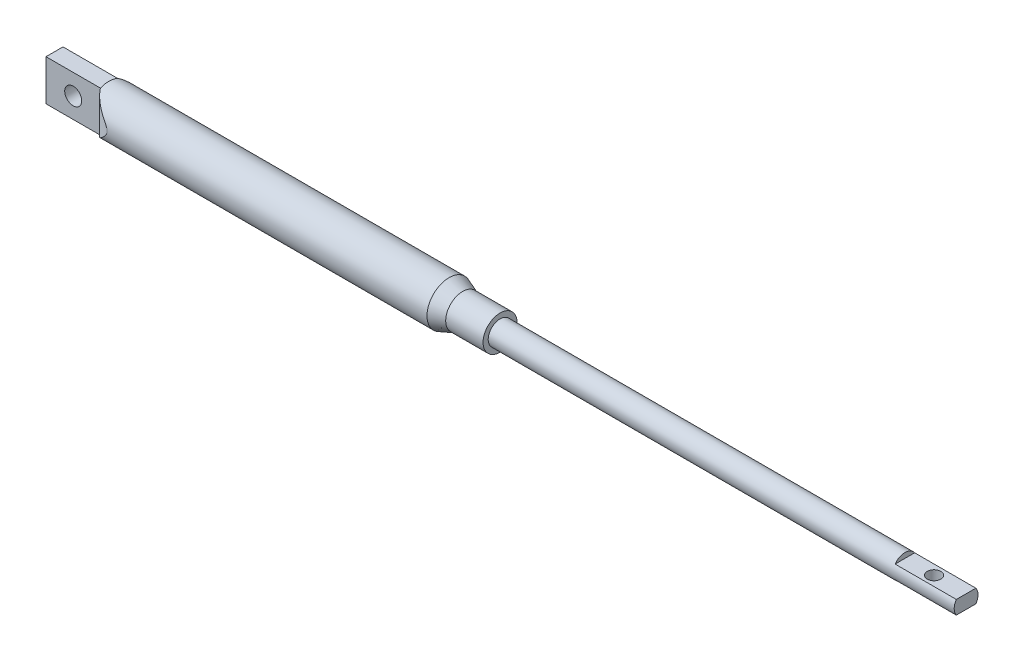
ISO-10303-21;
HEADER;
FILE_DESCRIPTION(('STEP AP214'),'2;1');
FILE_NAME('part.step','',(''),(''),'','','');
FILE_SCHEMA(('AUTOMOTIVE_DESIGN { 1 0 10303 214 1 1 1 1 }'));
ENDSEC;
DATA;
#1=APPLICATION_CONTEXT('core data for automotive mechanical design processes');
#2=APPLICATION_PROTOCOL_DEFINITION('international standard','automotive_design',2000,#1);
#3=PRODUCT_CONTEXT('',#1,'mechanical');
#4=PRODUCT('Part','Part','',(#3));
#5=PRODUCT_RELATED_PRODUCT_CATEGORY('part','',(#4));
#6=PRODUCT_DEFINITION_FORMATION('','',#4);
#7=PRODUCT_DEFINITION_CONTEXT('part definition',#1,'design');
#8=PRODUCT_DEFINITION('design','',#6,#7);
#9=PRODUCT_DEFINITION_SHAPE('','',#8);
#10=(LENGTH_UNIT() NAMED_UNIT(*) SI_UNIT(.MILLI.,.METRE.));
#11=(NAMED_UNIT(*) PLANE_ANGLE_UNIT() SI_UNIT($,.RADIAN.));
#12=(NAMED_UNIT(*) SI_UNIT($,.STERADIAN.) SOLID_ANGLE_UNIT());
#13=UNCERTAINTY_MEASURE_WITH_UNIT(LENGTH_MEASURE(1.E-05),#10,'distance_accuracy_value','');
#14=(GEOMETRIC_REPRESENTATION_CONTEXT(3) GLOBAL_UNCERTAINTY_ASSIGNED_CONTEXT((#13)) GLOBAL_UNIT_ASSIGNED_CONTEXT((#10,
#11,#12)) REPRESENTATION_CONTEXT('',''));
#15=CARTESIAN_POINT('',(0.,0.,0.));
#16=DIRECTION('',(0.,0.,1.));
#17=DIRECTION('',(1.,0.,0.));
#18=AXIS2_PLACEMENT_3D('',#15,#16,#17);
#19=CARTESIAN_POINT('',(0.,0.,0.));
#20=DIRECTION('',(-1.,0.,0.));
#21=DIRECTION('',(0.,0.,1.));
#22=AXIS2_PLACEMENT_3D('',#19,#20,#21);
#23=CYLINDRICAL_SURFACE('',#22,3.49999999999996);
#24=CARTESIAN_POINT('',(131.,0.,0.));
#25=DIRECTION('',(-1.,0.,0.));
#26=DIRECTION('',(0.,0.,1.));
#27=AXIS2_PLACEMENT_3D('',#24,#25,#26);
#28=CIRCLE('',#27,3.49999999999998);
#29=CARTESIAN_POINT('',(131.,0.,3.49999999999995));
#30=VERTEX_POINT('',#29);
#31=EDGE_CURVE('E141',#30,#30,#28,.T.);
#32=ORIENTED_EDGE('',*,*,#31,.F.);
#33=EDGE_LOOP('',(#32));
#34=FACE_BOUND('',#33,.T.);
#35=CARTESIAN_POINT('',(268.,0.,0.));
#36=DIRECTION('',(-1.,0.,0.));
#37=DIRECTION('',(0.,0.,1.));
#38=AXIS2_PLACEMENT_3D('',#35,#36,#37);
#39=CIRCLE('',#38,3.49999999999995);
#40=CARTESIAN_POINT('',(268.,2.,-2.872281323269));
#41=VERTEX_POINT('',#40);
#42=CARTESIAN_POINT('',(268.,-2.,-2.87228132326901));
#43=VERTEX_POINT('',#42);
#44=EDGE_CURVE('E108',#41,#43,#39,.T.);
#45=ORIENTED_EDGE('',*,*,#44,.T.);
#46=DIRECTION('',(-1.,0.,0.));
#47=VECTOR('',#46,1.);
#48=CARTESIAN_POINT('',(0.,-2.,-2.87228132326897));
#49=LINE('',#48,#47);
#50=CARTESIAN_POINT('',(250.,-2.,-2.87228132326902));
#51=VERTEX_POINT('',#50);
#52=EDGE_CURVE('E48',#43,#51,#49,.T.);
#53=ORIENTED_EDGE('',*,*,#52,.T.);
#54=CARTESIAN_POINT('',(250.,0.,0.));
#55=DIRECTION('',(1.,0.,0.));
#56=DIRECTION('',(0.,0.,-1.));
#57=AXIS2_PLACEMENT_3D('',#54,#55,#56);
#58=CIRCLE('',#57,3.49999999999996);
#59=CARTESIAN_POINT('',(250.,-2.,2.87228132326892));
#60=VERTEX_POINT('',#59);
#61=EDGE_CURVE('E11',#60,#51,#58,.T.);
#62=ORIENTED_EDGE('',*,*,#61,.F.);
#63=DIRECTION('',(-1.,0.,0.));
#64=VECTOR('',#63,1.);
#65=CARTESIAN_POINT('',(0.,-2.,2.87228132326897));
#66=LINE('',#65,#64);
#67=CARTESIAN_POINT('',(268.,-2.,2.87228132326891));
#68=VERTEX_POINT('',#67);
#69=EDGE_CURVE('E103',#60,#68,#66,.F.);
#70=ORIENTED_EDGE('',*,*,#69,.T.);
#71=CARTESIAN_POINT('',(268.,2.,2.8722813232689));
#72=VERTEX_POINT('',#71);
#73=EDGE_CURVE('E56',#68,#72,#39,.T.);
#74=ORIENTED_EDGE('',*,*,#73,.T.);
#75=DIRECTION('',(-1.,0.,0.));
#76=VECTOR('',#75,1.);
#77=CARTESIAN_POINT('',(0.,1.99999999999993,2.87228132326901));
#78=LINE('',#77,#76);
#79=CARTESIAN_POINT('',(250.,2.,2.87228132326893));
#80=VERTEX_POINT('',#79);
#81=EDGE_CURVE('E112',#80,#72,#78,.F.);
#82=ORIENTED_EDGE('',*,*,#81,.F.);
#83=CARTESIAN_POINT('',(250.,0.,0.));
#84=DIRECTION('',(1.,0.,0.));
#85=DIRECTION('',(0.,0.,-1.));
#86=AXIS2_PLACEMENT_3D('',#83,#84,#85);
#87=CIRCLE('',#86,3.49999999999996);
#88=CARTESIAN_POINT('',(250.,2.,-2.87228132326902));
#89=VERTEX_POINT('',#88);
#90=EDGE_CURVE('E235',#89,#80,#87,.T.);
#91=ORIENTED_EDGE('',*,*,#90,.F.);
#92=DIRECTION('',(-1.,0.,0.));
#93=VECTOR('',#92,1.);
#94=CARTESIAN_POINT('',(0.,1.99999999999993,-2.87228132326901));
#95=LINE('',#94,#93);
#96=EDGE_CURVE('E117',#41,#89,#95,.T.);
#97=ORIENTED_EDGE('',*,*,#96,.F.);
#98=EDGE_LOOP('',(#45,#53,#62,#70,#74,#82,#91,#97));
#99=FACE_BOUND('',#98,.T.);
#100=ADVANCED_FACE('F32',(#34,#99),#23,.T.);
#101=CARTESIAN_POINT('',(268.,0.,-3.5));
#102=DIRECTION('',(-1.,0.,0.));
#103=DIRECTION('',(0.,0.,1.));
#104=AXIS2_PLACEMENT_3D('',#101,#102,#103);
#105=PLANE('',#104);
#106=ORIENTED_EDGE('',*,*,#73,.F.);
#107=DIRECTION('',(0.,0.,-1.));
#108=VECTOR('',#107,1.);
#109=CARTESIAN_POINT('',(268.,-2.,-3.5));
#110=LINE('',#109,#108);
#111=EDGE_CURVE('E41',#68,#43,#110,.T.);
#112=ORIENTED_EDGE('',*,*,#111,.T.);
#113=ORIENTED_EDGE('',*,*,#44,.F.);
#114=DIRECTION('',(0.,0.,-1.));
#115=VECTOR('',#114,1.);
#116=CARTESIAN_POINT('',(268.,2.,-3.5));
#117=LINE('',#116,#115);
#118=EDGE_CURVE('E233',#72,#41,#117,.T.);
#119=ORIENTED_EDGE('',*,*,#118,.F.);
#120=EDGE_LOOP('',(#106,#112,#113,#119));
#121=FACE_BOUND('',#120,.T.);
#122=ADVANCED_FACE('F183',(#121),#105,.F.);
#123=CARTESIAN_POINT('',(0.,0.,0.));
#124=DIRECTION('',(1.,0.,0.));
#125=DIRECTION('',(0.,0.,-1.));
#126=AXIS2_PLACEMENT_3D('',#123,#124,#125);
#127=PLANE('',#126);
#128=DIRECTION('',(0.,1.,0.));
#129=VECTOR('',#128,1.);
#130=CARTESIAN_POINT('',(0.,-21.,2.5));
#131=LINE('',#130,#129);
#132=CARTESIAN_POINT('',(0.,-6.,2.5));
#133=VERTEX_POINT('',#132);
#134=CARTESIAN_POINT('',(0.,5.99999999999998,2.5));
#135=VERTEX_POINT('',#134);
#136=EDGE_CURVE('E129',#133,#135,#131,.T.);
#137=ORIENTED_EDGE('',*,*,#136,.T.);
#138=DIRECTION('',(0.,0.,-1.));
#139=VECTOR('',#138,1.);
#140=CARTESIAN_POINT('',(0.,5.99999999999998,0.));
#141=LINE('',#140,#139);
#142=CARTESIAN_POINT('',(0.,5.99999999999998,-2.5));
#143=VERTEX_POINT('',#142);
#144=EDGE_CURVE('E122',#135,#143,#141,.T.);
#145=ORIENTED_EDGE('',*,*,#144,.T.);
#146=DIRECTION('',(0.,1.,0.));
#147=VECTOR('',#146,1.);
#148=CARTESIAN_POINT('',(0.,-21.,-2.5));
#149=LINE('',#148,#147);
#150=CARTESIAN_POINT('',(0.,-5.99999999999999,-2.5));
#151=VERTEX_POINT('',#150);
#152=EDGE_CURVE('E135',#151,#143,#149,.T.);
#153=ORIENTED_EDGE('',*,*,#152,.F.);
#154=CARTESIAN_POINT('',(0.,0.,0.));
#155=DIRECTION('',(-1.,0.,0.));
#156=DIRECTION('',(0.,0.,1.));
#157=AXIS2_PLACEMENT_3D('',#154,#155,#156);
#158=CIRCLE('',#157,6.5);
#159=EDGE_CURVE('E153',#151,#133,#158,.T.);
#160=ORIENTED_EDGE('',*,*,#159,.T.);
#161=EDGE_LOOP('',(#137,#145,#153,#160));
#162=FACE_BOUND('',#161,.T.);
#163=ADVANCED_FACE('F34',(#162),#127,.F.);
#164=CARTESIAN_POINT('',(0.,0.,0.));
#165=DIRECTION('',(-1.,0.,0.));
#166=DIRECTION('',(0.,0.,1.));
#167=AXIS2_PLACEMENT_3D('',#164,#165,#166);
#168=CYLINDRICAL_SURFACE('',#167,6.49999999999999);
#169=CARTESIAN_POINT('',(116.,0.,0.));
#170=DIRECTION('',(-1.,0.,0.));
#171=DIRECTION('',(0.,0.,1.));
#172=AXIS2_PLACEMENT_3D('',#169,#170,#171);
#173=CIRCLE('',#172,6.49999999999998);
#174=CARTESIAN_POINT('',(116.,0.,6.49999999999996));
#175=VERTEX_POINT('',#174);
#176=EDGE_CURVE('E150',#175,#175,#173,.T.);
#177=ORIENTED_EDGE('',*,*,#176,.T.);
#178=EDGE_LOOP('',(#177));
#179=FACE_BOUND('',#178,.T.);
#180=CARTESIAN_POINT('',(16.,-5.99999999999999,-2.50000000000001));
#181=CARTESIAN_POINT('',(16.1484494594922,-5.90938990289274,-2.71734269900696));
#182=CARTESIAN_POINT('',(16.3037101142232,-5.80884932527033,-2.92551099457339));
#183=CARTESIAN_POINT('',(16.6252260829435,-5.59096415295657,-3.3230290223218));
#184=CARTESIAN_POINT('',(16.7914588344629,-5.47365349751902,-3.51241548479458));
#185=CARTESIAN_POINT('',(17.1324335994502,-5.22524216171741,-3.87227354729814));
#186=CARTESIAN_POINT('',(17.307151000186,-5.09418022234232,-4.04279564584456));
#187=CARTESIAN_POINT('',(17.6637124913466,-4.82006712248803,-4.36599140291043));
#188=CARTESIAN_POINT('',(17.8455605916584,-4.67700916314693,-4.51865482085299));
#189=CARTESIAN_POINT('',(18.2567377758266,-4.34679618849391,-4.83939904511017));
#190=CARTESIAN_POINT('',(18.4874285615401,-4.15703019621067,-5.00304250189977));
#191=CARTESIAN_POINT('',(18.9539964265711,-3.76404100569562,-5.30504321120168));
#192=CARTESIAN_POINT('',(19.1898756701811,-3.56081211766841,-5.44338967841786));
#193=CARTESIAN_POINT('',(19.5448480787171,-3.24655264782493,-5.63247694470444));
#194=CARTESIAN_POINT('',(19.6633308299185,-3.14026149817682,-5.69241962445623));
#195=CARTESIAN_POINT('',(19.9001801357725,-2.92438092615222,-5.80628083548967));
#196=CARTESIAN_POINT('',(20.0185467004605,-2.81479182041138,-5.86019994276499));
#197=CARTESIAN_POINT('',(20.2543688931388,-2.59211944476005,-5.9620380252908));
#198=CARTESIAN_POINT('',(20.3718251916885,-2.47903913006989,-6.0099619106473));
#199=CARTESIAN_POINT('',(20.6048955963421,-2.24872719357026,-6.09987812261651));
#200=CARTESIAN_POINT('',(20.7205100713612,-2.13149641864606,-6.14187165067055));
#201=CARTESIAN_POINT('',(20.9518608911146,-1.88804414793653,-6.22110980769565));
#202=CARTESIAN_POINT('',(21.0674877312617,-1.76165608016347,-6.25816460078261));
#203=CARTESIAN_POINT('',(21.2920712468606,-1.5010465104376,-6.3257446444648));
#204=CARTESIAN_POINT('',(21.4010228314498,-1.36681917859357,-6.35626495473784));
#205=CARTESIAN_POINT('',(21.5826910831859,-1.11794602673882,-6.40410084456605));
#206=CARTESIAN_POINT('',(21.6580846958566,-1.00556057080674,-6.42284377775305));
#207=CARTESIAN_POINT('',(21.7938978100595,-0.771275128338926,-6.45515511059635));
#208=CARTESIAN_POINT('',(21.8543698225722,-0.649410551230072,-6.46874174944952));
#209=CARTESIAN_POINT('',(21.9292976617158,-0.446267566095537,-6.4851066964052));
#210=CARTESIAN_POINT('',(21.9524740696772,-0.368481735273583,-6.49003401580001));
#211=CARTESIAN_POINT('',(21.9859112889147,-0.210125279983128,-6.49708321939111));
#212=CARTESIAN_POINT('',(21.996205517502,-0.129562420173283,-6.49921236298335));
#213=CARTESIAN_POINT('',(22.0020500663714,0.0325683276555243,-6.50042579434219));
#214=CARTESIAN_POINT('',(21.997524138427,0.114139255360633,-6.49949433552981));
#215=CARTESIAN_POINT('',(21.9744585513289,0.275216439838483,-6.49467367403736));
#216=CARTESIAN_POINT('',(21.9558929121347,0.354718585934891,-6.49077898791744));
#217=CARTESIAN_POINT('',(21.8962473396086,0.547130883340215,-6.47795531002232));
#218=CARTESIAN_POINT('',(21.8486476349269,0.657846073575852,-6.46750982379642));
#219=CARTESIAN_POINT('',(21.7389121036933,0.871372279091274,-6.44223424877912));
#220=CARTESIAN_POINT('',(21.6767116442827,0.974145367362006,-6.42738458477437));
#221=CARTESIAN_POINT('',(21.5555398158521,1.15573019236121,-6.39696572308616));
#222=CARTESIAN_POINT('',(21.4979313354713,1.23557268780613,-6.38198457578239));
#223=CARTESIAN_POINT('',(21.3788201208824,1.3918411301661,-6.34973552206266));
#224=CARTESIAN_POINT('',(21.3173155917216,1.46826547422958,-6.3324665575663));
#225=CARTESIAN_POINT('',(21.1286944896247,1.69377657297086,-6.27735430633345));
#226=CARTESIAN_POINT('',(20.9976870739926,1.83879882783136,-6.23625840662731));
#227=CARTESIAN_POINT('',(20.730082633755,2.12223654780355,-6.14559115342899));
#228=CARTESIAN_POINT('',(20.5934590888609,2.26061180030002,-6.09597492931362));
#229=CARTESIAN_POINT('',(20.3179806011259,2.53150842924318,-5.98854342165269));
#230=CARTESIAN_POINT('',(20.1791281164042,2.66403572124176,-5.93073668477124));
#231=CARTESIAN_POINT('',(19.801834180733,3.01663388348027,-5.76287351743697));
#232=CARTESIAN_POINT('',(19.5626098501787,3.23212614861924,-5.64483870907689));
#233=CARTESIAN_POINT('',(19.0863568478998,3.65045268540281,-5.38376539398446));
#234=CARTESIAN_POINT('',(18.8493301540287,3.85327634938437,-5.24070630494032));
#235=CARTESIAN_POINT('',(18.3823772294047,4.24382921455009,-4.92968623267118));
#236=CARTESIAN_POINT('',(18.152414883211,4.43164788857513,-4.76189300163885));
#237=CARTESIAN_POINT('',(17.7012150344009,4.79123189144928,-4.39990205172345));
#238=CARTESIAN_POINT('',(17.479970602622,4.96301012463825,-4.20572587182436));
#239=CARTESIAN_POINT('',(17.0382728653344,5.29558517720852,-3.77934734339839));
#240=CARTESIAN_POINT('',(16.8184251272892,5.45538765975949,-3.54571876860744));
#241=CARTESIAN_POINT('',(16.5013440436963,5.6754571881291,-3.17178959644898));
#242=CARTESIAN_POINT('',(16.3975035512016,5.74570348017344,-3.04285365896525));
#243=CARTESIAN_POINT('',(16.1948209949413,5.87869925880258,-2.77722030442283));
#244=CARTESIAN_POINT('',(16.0959832223565,5.94144237019692,-2.64051643065321));
#245=CARTESIAN_POINT('',(16.,5.99999999999998,-2.50000000000001));
#246=B_SPLINE_CURVE_WITH_KNOTS('',3,(#180,#181,#182,#183,#184,#185,#186,#187,#188,#189,#190,
#191,#192,#193,#194,#195,#196,#197,#198,#199,#200,#201,#202,#203,#204,#205,#206,#207,#208,#209,
#210,#211,#212,#213,#214,#215,#216,#217,#218,#219,#220,#221,#222,#223,#224,#225,#226,#227,#228,
#229,#230,#231,#232,#233,#234,#235,#236,#237,#238,#239,#240,#241,#242,#243,#244,#245),
.UNSPECIFIED.,.F.,.F.,(4,2,2,2,2,2,2,2,2,2,2,2,2,2,2,2,2,2,2,2,2,2,2,2,2,2,2,2,2,2,2,2,4),(0.,
0.834243421226848,1.66682179535552,2.49711454389378,3.32788109142027,4.34831448920463,
5.36918193645554,5.87932744038192,6.38942412069885,6.89910025638716,7.40867298732082,
7.93419912289614,8.46012118444647,8.86939113226318,9.27719958129508,9.52025947151273,
9.76268753077889,10.0063648139993,10.2504941210661,10.6113116155354,10.9737575001259,
11.2723258479298,11.5710327642312,12.1695696812378,12.771361172648,13.3725292671045,
14.4000934701112,15.428506846616,16.450241468427,17.4711469049141,18.5436692307715,
19.0828369004682,19.6224594752932),.UNSPECIFIED.);
#247=CARTESIAN_POINT('',(16.,-5.99999999999999,-2.5));
#248=VERTEX_POINT('',#247);
#249=CARTESIAN_POINT('',(16.,5.99999999999998,-2.5));
#250=VERTEX_POINT('',#249);
#251=EDGE_CURVE('E156',#248,#250,#246,.T.);
#252=ORIENTED_EDGE('',*,*,#251,.T.);
#253=CARTESIAN_POINT('',(16.,0.,0.));
#254=DIRECTION('',(1.,0.,0.));
#255=DIRECTION('',(0.,0.,-1.));
#256=AXIS2_PLACEMENT_3D('',#253,#254,#255);
#257=CIRCLE('',#256,6.49999999999999);
#258=CARTESIAN_POINT('',(16.,5.99999999999998,2.5));
#259=VERTEX_POINT('',#258);
#260=EDGE_CURVE('E125',#250,#259,#257,.T.);
#261=ORIENTED_EDGE('',*,*,#260,.T.);
#262=CARTESIAN_POINT('',(16.,-5.99999999999999,2.50000000000001));
#263=CARTESIAN_POINT('',(16.1484494594922,-5.90938990289274,2.71734269900695));
#264=CARTESIAN_POINT('',(16.3037101142232,-5.80884932527033,2.92551099457338));
#265=CARTESIAN_POINT('',(16.6252260829435,-5.59096415295657,3.32302902232179));
#266=CARTESIAN_POINT('',(16.7914588344629,-5.47365349751902,3.51241548479458));
#267=CARTESIAN_POINT('',(17.1324335994502,-5.22524216171741,3.87227354729814));
#268=CARTESIAN_POINT('',(17.307151000186,-5.09418022234232,4.04279564584456));
#269=CARTESIAN_POINT('',(17.6637124913466,-4.82006712248803,4.36599140291042));
#270=CARTESIAN_POINT('',(17.8455605916584,-4.67700916314692,4.51865482085299));
#271=CARTESIAN_POINT('',(18.2567377758266,-4.34679618849391,4.83939904511016));
#272=CARTESIAN_POINT('',(18.4874285615401,-4.15703019621066,5.00304250189976));
#273=CARTESIAN_POINT('',(18.953996426571,-3.76404100569561,5.30504321120168));
#274=CARTESIAN_POINT('',(19.1898756701811,-3.5608121176684,5.44338967841786));
#275=CARTESIAN_POINT('',(19.5448480787171,-3.24655264782493,5.63247694470444));
#276=CARTESIAN_POINT('',(19.6633308299185,-3.14026149817681,5.69241962445623));
#277=CARTESIAN_POINT('',(19.9001801357725,-2.92438092615222,5.80628083548966));
#278=CARTESIAN_POINT('',(20.0185467004605,-2.81479182041137,5.86019994276498));
#279=CARTESIAN_POINT('',(20.2543688931388,-2.59211944476005,5.9620380252908));
#280=CARTESIAN_POINT('',(20.3718251916885,-2.47903913006989,6.00996191064729));
#281=CARTESIAN_POINT('',(20.604895596342,-2.24872719357026,6.0998781226165));
#282=CARTESIAN_POINT('',(20.7205100713612,-2.13149641864606,6.14187165067055));
#283=CARTESIAN_POINT('',(20.9518608911145,-1.88804414793653,6.22110980769565));
#284=CARTESIAN_POINT('',(21.0674877312616,-1.76165608016346,6.25816460078261));
#285=CARTESIAN_POINT('',(21.2920712468606,-1.50104651043759,6.32574464446479));
#286=CARTESIAN_POINT('',(21.4010228314498,-1.36681917859356,6.35626495473783));
#287=CARTESIAN_POINT('',(21.5826910831859,-1.11794602673881,6.40410084456604));
#288=CARTESIAN_POINT('',(21.6580846958566,-1.00556057080673,6.42284377775305));
#289=CARTESIAN_POINT('',(21.7938978100595,-0.771275128338914,6.45515511059634));
#290=CARTESIAN_POINT('',(21.8543698225721,-0.649410551230067,6.46874174944951));
#291=CARTESIAN_POINT('',(21.9292976617158,-0.446267566095532,6.48510669640519));
#292=CARTESIAN_POINT('',(21.9524740696771,-0.368481735273574,6.4900340158));
#293=CARTESIAN_POINT('',(21.9859112889147,-0.210125279983116,6.4970832193911));
#294=CARTESIAN_POINT('',(21.996205517502,-0.12956242017327,6.49921236298334));
#295=CARTESIAN_POINT('',(22.0020500663714,0.032568327655539,6.50042579434218));
#296=CARTESIAN_POINT('',(21.997524138427,0.114139255360649,6.4994943355298));
#297=CARTESIAN_POINT('',(21.9744585513288,0.2752164398385,6.49467367403735));
#298=CARTESIAN_POINT('',(21.9558929121346,0.354718585934909,6.49077898791743));
#299=CARTESIAN_POINT('',(21.8962473396086,0.547130883340239,6.47795531002231));
#300=CARTESIAN_POINT('',(21.8486476349268,0.657846073575883,6.46750982379641));
#301=CARTESIAN_POINT('',(21.7389121036932,0.871372279091312,6.44223424877911));
#302=CARTESIAN_POINT('',(21.6767116442826,0.974145367362044,6.42738458477436));
#303=CARTESIAN_POINT('',(21.555539815852,1.15573019236126,6.39696572308614));
#304=CARTESIAN_POINT('',(21.4979313354713,1.23557268780617,6.38198457578237));
#305=CARTESIAN_POINT('',(21.3788201208823,1.39184113016615,6.34973552206264));
#306=CARTESIAN_POINT('',(21.3173155917215,1.46826547422964,6.33246655756628));
#307=CARTESIAN_POINT('',(21.1286944896246,1.69377657297092,6.27735430633342));
#308=CARTESIAN_POINT('',(20.9976870739925,1.83879882783143,6.23625840662728));
#309=CARTESIAN_POINT('',(20.7300826337549,2.12223654780364,6.14559115342896));
#310=CARTESIAN_POINT('',(20.5934590888608,2.26061180030011,6.09597492931358));
#311=CARTESIAN_POINT('',(20.3179806011258,2.53150842924328,5.98854342165264));
#312=CARTESIAN_POINT('',(20.1791281164041,2.66403572124185,5.93073668477119));
#313=CARTESIAN_POINT('',(19.8018341807328,3.01663388348036,5.76287351743691));
#314=CARTESIAN_POINT('',(19.5626098501786,3.23212614861933,5.64483870907683));
#315=CARTESIAN_POINT('',(19.0863568478997,3.6504526854029,5.38376539398439));
#316=CARTESIAN_POINT('',(18.8493301540286,3.85327634938445,5.24070630494026));
#317=CARTESIAN_POINT('',(18.3823772294046,4.24382921455016,4.92968623267112));
#318=CARTESIAN_POINT('',(18.1524148832109,4.43164788857519,4.76189300163879));
#319=CARTESIAN_POINT('',(17.7012150344008,4.79123189144934,4.39990205172337));
#320=CARTESIAN_POINT('',(17.4799706026219,4.9630101246383,4.20572587182428));
#321=CARTESIAN_POINT('',(17.0382728653343,5.29558517720856,3.77934734339833));
#322=CARTESIAN_POINT('',(16.8184251272892,5.45538765975952,3.54571876860738));
#323=CARTESIAN_POINT('',(16.5013440436963,5.67545718812912,3.17178959644894));
#324=CARTESIAN_POINT('',(16.3975035512016,5.74570348017346,3.04285365896521));
#325=CARTESIAN_POINT('',(16.1948209949412,5.87869925880258,2.77722030442281));
#326=CARTESIAN_POINT('',(16.0959832223565,5.94144237019692,2.6405164306532));
#327=CARTESIAN_POINT('',(16.,5.99999999999998,2.50000000000001));
#328=B_SPLINE_CURVE_WITH_KNOTS('',3,(#262,#263,#264,#265,#266,#267,#268,#269,#270,#271,#272,
#273,#274,#275,#276,#277,#278,#279,#280,#281,#282,#283,#284,#285,#286,#287,#288,#289,#290,#291,
#292,#293,#294,#295,#296,#297,#298,#299,#300,#301,#302,#303,#304,#305,#306,#307,#308,#309,#310,
#311,#312,#313,#314,#315,#316,#317,#318,#319,#320,#321,#322,#323,#324,#325,#326,#327),
.UNSPECIFIED.,.F.,.F.,(4,2,2,2,2,2,2,2,2,2,2,2,2,2,2,2,2,2,2,2,2,2,2,2,2,2,2,2,2,2,2,2,4),(0.,
0.834243421226849,1.66682179535551,2.49711454389378,3.32788109142027,4.34831448920463,
5.36918193645554,5.87932744038192,6.38942412069884,6.89910025638715,7.40867298732081,
7.93419912289613,8.46012118444646,8.86939113226317,9.27719958129507,9.52025947151271,
9.76268753077888,10.0063648139993,10.2504941210661,10.6113116155354,10.9737575001259,
11.2723258479299,11.5710327642312,12.1695696812378,12.7713611726481,13.3725292671046,
14.4000934701113,15.428506846616,16.4502414684271,17.4711469049142,18.5436692307715,
19.0828369004681,19.6224594752931),.UNSPECIFIED.);
#329=CARTESIAN_POINT('',(16.,-5.99999999999999,2.5));
#330=VERTEX_POINT('',#329);
#331=EDGE_CURVE('E222',#330,#259,#328,.T.);
#332=ORIENTED_EDGE('',*,*,#331,.F.);
#333=DIRECTION('',(-1.,0.,0.));
#334=VECTOR('',#333,1.);
#335=CARTESIAN_POINT('',(0.,-5.99999999999999,2.5));
#336=LINE('',#335,#334);
#337=EDGE_CURVE('E221',#133,#330,#336,.F.);
#338=ORIENTED_EDGE('',*,*,#337,.F.);
#339=ORIENTED_EDGE('',*,*,#159,.F.);
#340=DIRECTION('',(-1.,0.,0.));
#341=VECTOR('',#340,1.);
#342=CARTESIAN_POINT('',(0.,-5.99999999999999,-2.5));
#343=LINE('',#342,#341);
#344=EDGE_CURVE('E164',#151,#248,#343,.F.);
#345=ORIENTED_EDGE('',*,*,#344,.T.);
#346=EDGE_LOOP('',(#252,#261,#332,#338,#339,#345));
#347=FACE_BOUND('',#346,.T.);
#348=ADVANCED_FACE('F166',(#179,#347),#168,.T.);
#349=CARTESIAN_POINT('',(120.,0.,0.));
#350=DIRECTION('',(-1.,0.,0.));
#351=DIRECTION('',(0.,0.,1.));
#352=AXIS2_PLACEMENT_3D('',#349,#350,#351);
#353=CONICAL_SURFACE('',#352,4.99999999999998,0.358770670270572);
#354=ORIENTED_EDGE('',*,*,#176,.F.);
#355=EDGE_LOOP('',(#354));
#356=FACE_BOUND('',#355,.T.);
#357=CARTESIAN_POINT('',(120.,0.,0.));
#358=DIRECTION('',(-1.,0.,0.));
#359=DIRECTION('',(0.,0.,1.));
#360=AXIS2_PLACEMENT_3D('',#357,#358,#359);
#361=CIRCLE('',#360,4.99999999999998);
#362=CARTESIAN_POINT('',(120.,0.,4.99999999999996));
#363=VERTEX_POINT('',#362);
#364=EDGE_CURVE('E147',#363,#363,#361,.T.);
#365=ORIENTED_EDGE('',*,*,#364,.T.);
#366=EDGE_LOOP('',(#365));
#367=FACE_BOUND('',#366,.T.);
#368=ADVANCED_FACE('F195',(#356,#367),#353,.T.);
#369=CARTESIAN_POINT('',(0.,0.,0.));
#370=DIRECTION('',(-1.,0.,0.));
#371=DIRECTION('',(0.,0.,1.));
#372=AXIS2_PLACEMENT_3D('',#369,#370,#371);
#373=CYLINDRICAL_SURFACE('',#372,4.99999999999998);
#374=ORIENTED_EDGE('',*,*,#364,.F.);
#375=EDGE_LOOP('',(#374));
#376=FACE_BOUND('',#375,.T.);
#377=CARTESIAN_POINT('',(131.,0.,0.));
#378=DIRECTION('',(-1.,0.,0.));
#379=DIRECTION('',(0.,0.,1.));
#380=AXIS2_PLACEMENT_3D('',#377,#378,#379);
#381=CIRCLE('',#380,4.99999999999998);
#382=CARTESIAN_POINT('',(131.,0.,4.99999999999995));
#383=VERTEX_POINT('',#382);
#384=EDGE_CURVE('E144',#383,#383,#381,.T.);
#385=ORIENTED_EDGE('',*,*,#384,.T.);
#386=EDGE_LOOP('',(#385));
#387=FACE_BOUND('',#386,.T.);
#388=ADVANCED_FACE('F192',(#376,#387),#373,.T.);
#389=CARTESIAN_POINT('',(131.,0.,-5.));
#390=DIRECTION('',(-1.,0.,0.));
#391=DIRECTION('',(0.,0.,1.));
#392=AXIS2_PLACEMENT_3D('',#389,#390,#391);
#393=PLANE('',#392);
#394=ORIENTED_EDGE('',*,*,#384,.F.);
#395=EDGE_LOOP('',(#394));
#396=FACE_BOUND('',#395,.T.);
#397=ORIENTED_EDGE('',*,*,#31,.T.);
#398=EDGE_LOOP('',(#397));
#399=FACE_BOUND('',#398,.T.);
#400=ADVANCED_FACE('F181',(#396,#399),#393,.F.);
#401=CARTESIAN_POINT('',(0.,-21.,-2.5));
#402=DIRECTION('',(0.,0.,1.));
#403=DIRECTION('',(1.,0.,0.));
#404=AXIS2_PLACEMENT_3D('',#401,#402,#403);
#405=PLANE('',#404);
#406=CARTESIAN_POINT('',(8.,0.,-2.5));
#407=DIRECTION('',(0.,0.,1.));
#408=DIRECTION('',(1.,0.,0.));
#409=AXIS2_PLACEMENT_3D('',#406,#407,#408);
#410=CIRCLE('',#409,2.5);
#411=CARTESIAN_POINT('',(10.5,0.,-2.5));
#412=VERTEX_POINT('',#411);
#413=EDGE_CURVE('E382',#412,#412,#410,.T.);
#414=ORIENTED_EDGE('',*,*,#413,.T.);
#415=EDGE_LOOP('',(#414));
#416=FACE_BOUND('',#415,.T.);
#417=DIRECTION('',(0.,1.,0.));
#418=VECTOR('',#417,1.);
#419=CARTESIAN_POINT('',(16.,-21.,-2.5));
#420=LINE('',#419,#418);
#421=EDGE_CURVE('E132',#248,#250,#420,.T.);
#422=ORIENTED_EDGE('',*,*,#421,.F.);
#423=ORIENTED_EDGE('',*,*,#344,.F.);
#424=ORIENTED_EDGE('',*,*,#152,.T.);
#425=DIRECTION('',(-1.,0.,0.));
#426=VECTOR('',#425,1.);
#427=CARTESIAN_POINT('',(0.,5.99999999999999,-2.5));
#428=LINE('',#427,#426);
#429=EDGE_CURVE('E219',#250,#143,#428,.T.);
#430=ORIENTED_EDGE('',*,*,#429,.F.);
#431=EDGE_LOOP('',(#422,#423,#424,#430));
#432=FACE_BOUND('',#431,.T.);
#433=ADVANCED_FACE('F175',(#416,#432),#405,.F.);
#434=CARTESIAN_POINT('',(23.9566424676983,-21.,2.93496370154744));
#435=DIRECTION('',(0.,1.,0.));
#436=DIRECTION('',(0.,0.,1.));
#437=AXIS2_PLACEMENT_3D('',#434,#435,#436);
#438=CYLINDRICAL_SURFACE('',#437,9.63571428571427);
#439=ORIENTED_EDGE('',*,*,#421,.T.);
#440=ORIENTED_EDGE('',*,*,#251,.F.);
#441=EDGE_LOOP('',(#439,#440));
#442=FACE_BOUND('',#441,.T.);
#443=ADVANCED_FACE('F169',(#442),#438,.T.);
#444=CARTESIAN_POINT('',(23.9566424676983,-21.,-2.93496370154744));
#445=DIRECTION('',(0.,1.,0.));
#446=DIRECTION('',(0.,0.,1.));
#447=AXIS2_PLACEMENT_3D('',#444,#445,#446);
#448=CYLINDRICAL_SURFACE('',#447,9.63571428571427);
#449=ORIENTED_EDGE('',*,*,#331,.T.);
#450=DIRECTION('',(0.,1.,0.));
#451=VECTOR('',#450,1.);
#452=CARTESIAN_POINT('',(16.,-21.,2.5));
#453=LINE('',#452,#451);
#454=EDGE_CURVE('E128',#330,#259,#453,.T.);
#455=ORIENTED_EDGE('',*,*,#454,.F.);
#456=EDGE_LOOP('',(#449,#455));
#457=FACE_BOUND('',#456,.T.);
#458=ADVANCED_FACE('F174',(#457),#448,.T.);
#459=CARTESIAN_POINT('',(0.,-21.,2.5));
#460=DIRECTION('',(0.,0.,1.));
#461=DIRECTION('',(1.,0.,0.));
#462=AXIS2_PLACEMENT_3D('',#459,#460,#461);
#463=PLANE('',#462);
#464=CARTESIAN_POINT('',(8.,0.,2.5));
#465=DIRECTION('',(0.,0.,1.));
#466=DIRECTION('',(1.,0.,0.));
#467=AXIS2_PLACEMENT_3D('',#464,#465,#466);
#468=CIRCLE('',#467,2.5);
#469=CARTESIAN_POINT('',(10.5,0.,2.5));
#470=VERTEX_POINT('',#469);
#471=EDGE_CURVE('E269',#470,#470,#468,.T.);
#472=ORIENTED_EDGE('',*,*,#471,.F.);
#473=EDGE_LOOP('',(#472));
#474=FACE_BOUND('',#473,.T.);
#475=DIRECTION('',(-1.,0.,0.));
#476=VECTOR('',#475,1.);
#477=CARTESIAN_POINT('',(0.,5.99999999999999,2.5));
#478=LINE('',#477,#476);
#479=EDGE_CURVE('E230',#259,#135,#478,.T.);
#480=ORIENTED_EDGE('',*,*,#479,.T.);
#481=ORIENTED_EDGE('',*,*,#136,.F.);
#482=ORIENTED_EDGE('',*,*,#337,.T.);
#483=ORIENTED_EDGE('',*,*,#454,.T.);
#484=EDGE_LOOP('',(#480,#481,#482,#483));
#485=FACE_BOUND('',#484,.T.);
#486=ADVANCED_FACE('F258',(#474,#485),#463,.T.);
#487=CARTESIAN_POINT('',(16.,5.99999999999998,22.5));
#488=DIRECTION('',(1.,0.,0.));
#489=DIRECTION('',(0.,0.,-1.));
#490=AXIS2_PLACEMENT_3D('',#487,#488,#489);
#491=PLANE('',#490);
#492=DIRECTION('',(0.,0.,-1.));
#493=VECTOR('',#492,1.);
#494=CARTESIAN_POINT('',(16.,5.99999999999998,22.5));
#495=LINE('',#494,#493);
#496=EDGE_CURVE('E119',#259,#250,#495,.T.);
#497=ORIENTED_EDGE('',*,*,#496,.F.);
#498=ORIENTED_EDGE('',*,*,#260,.F.);
#499=EDGE_LOOP('',(#497,#498));
#500=FACE_BOUND('',#499,.T.);
#501=ADVANCED_FACE('F253',(#500),#491,.F.);
#502=CARTESIAN_POINT('',(16.,5.99999999999998,22.5));
#503=DIRECTION('',(0.,-1.,0.));
#504=DIRECTION('',(0.,0.,-1.));
#505=AXIS2_PLACEMENT_3D('',#502,#503,#504);
#506=PLANE('',#505);
#507=ORIENTED_EDGE('',*,*,#479,.F.);
#508=ORIENTED_EDGE('',*,*,#496,.T.);
#509=ORIENTED_EDGE('',*,*,#429,.T.);
#510=ORIENTED_EDGE('',*,*,#144,.F.);
#511=EDGE_LOOP('',(#507,#508,#509,#510));
#512=FACE_BOUND('',#511,.T.);
#513=ADVANCED_FACE('F245',(#512),#506,.F.);
#514=CARTESIAN_POINT('',(250.,0.,-5.));
#515=DIRECTION('',(1.,0.,0.));
#516=DIRECTION('',(0.,0.,-1.));
#517=AXIS2_PLACEMENT_3D('',#514,#515,#516);
#518=PLANE('',#517);
#519=ORIENTED_EDGE('',*,*,#90,.T.);
#520=DIRECTION('',(0.,0.,1.));
#521=VECTOR('',#520,1.);
#522=CARTESIAN_POINT('',(250.,2.,-5.));
#523=LINE('',#522,#521);
#524=EDGE_CURVE('E109',#89,#80,#523,.T.);
#525=ORIENTED_EDGE('',*,*,#524,.F.);
#526=EDGE_LOOP('',(#519,#525));
#527=FACE_BOUND('',#526,.T.);
#528=ADVANCED_FACE('F243',(#527),#518,.T.);
#529=CARTESIAN_POINT('',(0.,1.99999999999993,-5.));
#530=DIRECTION('',(0.,1.,0.));
#531=DIRECTION('',(-1.,0.,0.));
#532=AXIS2_PLACEMENT_3D('',#529,#530,#531);
#533=PLANE('',#532);
#534=CARTESIAN_POINT('',(258.568042263347,2.,0.));
#535=DIRECTION('',(0.,1.,0.));
#536=DIRECTION('',(-1.,0.,0.));
#537=AXIS2_PLACEMENT_3D('',#534,#535,#536);
#538=CIRCLE('',#537,2.);
#539=CARTESIAN_POINT('',(256.568042263347,2.,0.));
#540=VERTEX_POINT('',#539);
#541=EDGE_CURVE('E383',#540,#540,#538,.T.);
#542=ORIENTED_EDGE('',*,*,#541,.F.);
#543=EDGE_LOOP('',(#542));
#544=FACE_BOUND('',#543,.T.);
#545=ORIENTED_EDGE('',*,*,#96,.T.);
#546=ORIENTED_EDGE('',*,*,#524,.T.);
#547=ORIENTED_EDGE('',*,*,#81,.T.);
#548=ORIENTED_EDGE('',*,*,#118,.T.);
#549=EDGE_LOOP('',(#545,#546,#547,#548));
#550=FACE_BOUND('',#549,.T.);
#551=ADVANCED_FACE('F239',(#544,#550),#533,.T.);
#552=CARTESIAN_POINT('',(250.,0.,-5.));
#553=DIRECTION('',(1.,0.,0.));
#554=DIRECTION('',(0.,0.,-1.));
#555=AXIS2_PLACEMENT_3D('',#552,#553,#554);
#556=PLANE('',#555);
#557=ORIENTED_EDGE('',*,*,#61,.T.);
#558=DIRECTION('',(0.,0.,1.));
#559=VECTOR('',#558,1.);
#560=CARTESIAN_POINT('',(250.,-2.,-5.));
#561=LINE('',#560,#559);
#562=EDGE_CURVE('E101',#51,#60,#561,.T.);
#563=ORIENTED_EDGE('',*,*,#562,.T.);
#564=EDGE_LOOP('',(#557,#563));
#565=FACE_BOUND('',#564,.T.);
#566=ADVANCED_FACE('F100',(#565),#556,.T.);
#567=CARTESIAN_POINT('',(0.,-2.,-5.));
#568=DIRECTION('',(0.,1.,0.));
#569=DIRECTION('',(0.,0.,1.));
#570=AXIS2_PLACEMENT_3D('',#567,#568,#569);
#571=PLANE('',#570);
#572=CARTESIAN_POINT('',(258.568042263347,-2.,0.));
#573=DIRECTION('',(0.,1.,0.));
#574=DIRECTION('',(0.,0.,1.));
#575=AXIS2_PLACEMENT_3D('',#572,#573,#574);
#576=CIRCLE('',#575,2.);
#577=CARTESIAN_POINT('',(258.568042263347,-2.,2.));
#578=VERTEX_POINT('',#577);
#579=EDGE_CURVE('E36',#578,#578,#576,.T.);
#580=ORIENTED_EDGE('',*,*,#579,.T.);
#581=EDGE_LOOP('',(#580));
#582=FACE_BOUND('',#581,.T.);
#583=ORIENTED_EDGE('',*,*,#111,.F.);
#584=ORIENTED_EDGE('',*,*,#69,.F.);
#585=ORIENTED_EDGE('',*,*,#562,.F.);
#586=ORIENTED_EDGE('',*,*,#52,.F.);
#587=EDGE_LOOP('',(#583,#584,#585,#586));
#588=FACE_BOUND('',#587,.T.);
#589=ADVANCED_FACE('F102',(#582,#588),#571,.F.);
#590=CARTESIAN_POINT('',(258.568042263347,-8.,0.));
#591=DIRECTION('',(0.,1.,0.));
#592=DIRECTION('',(-1.,0.,0.));
#593=AXIS2_PLACEMENT_3D('',#590,#591,#592);
#594=CYLINDRICAL_SURFACE('',#593,2.);
#595=ORIENTED_EDGE('',*,*,#541,.T.);
#596=EDGE_LOOP('',(#595));
#597=FACE_BOUND('',#596,.T.);
#598=ORIENTED_EDGE('',*,*,#579,.F.);
#599=EDGE_LOOP('',(#598));
#600=FACE_BOUND('',#599,.T.);
#601=ADVANCED_FACE('F347',(#597,#600),#594,.F.);
#602=CARTESIAN_POINT('',(8.,0.,-7.5));
#603=DIRECTION('',(0.,0.,1.));
#604=DIRECTION('',(1.,0.,0.));
#605=AXIS2_PLACEMENT_3D('',#602,#603,#604);
#606=CYLINDRICAL_SURFACE('',#605,2.5);
#607=ORIENTED_EDGE('',*,*,#471,.T.);
#608=EDGE_LOOP('',(#607));
#609=FACE_BOUND('',#608,.T.);
#610=ORIENTED_EDGE('',*,*,#413,.F.);
#611=EDGE_LOOP('',(#610));
#612=FACE_BOUND('',#611,.T.);
#613=ADVANCED_FACE('F357',(#609,#612),#606,.F.);
#614=CLOSED_SHELL('',(#100,#122,#163,#348,#368,#388,#400,#433,#443,#458,#486,#501,#513,#528,
#551,#566,#589,#601,#613));
#615=MANIFOLD_SOLID_BREP('B2',#614);
#616=ADVANCED_BREP_SHAPE_REPRESENTATION('',(#18,#615),#14);
#617=SHAPE_DEFINITION_REPRESENTATION(#9,#616);
ENDSEC;
END-ISO-10303-21;
